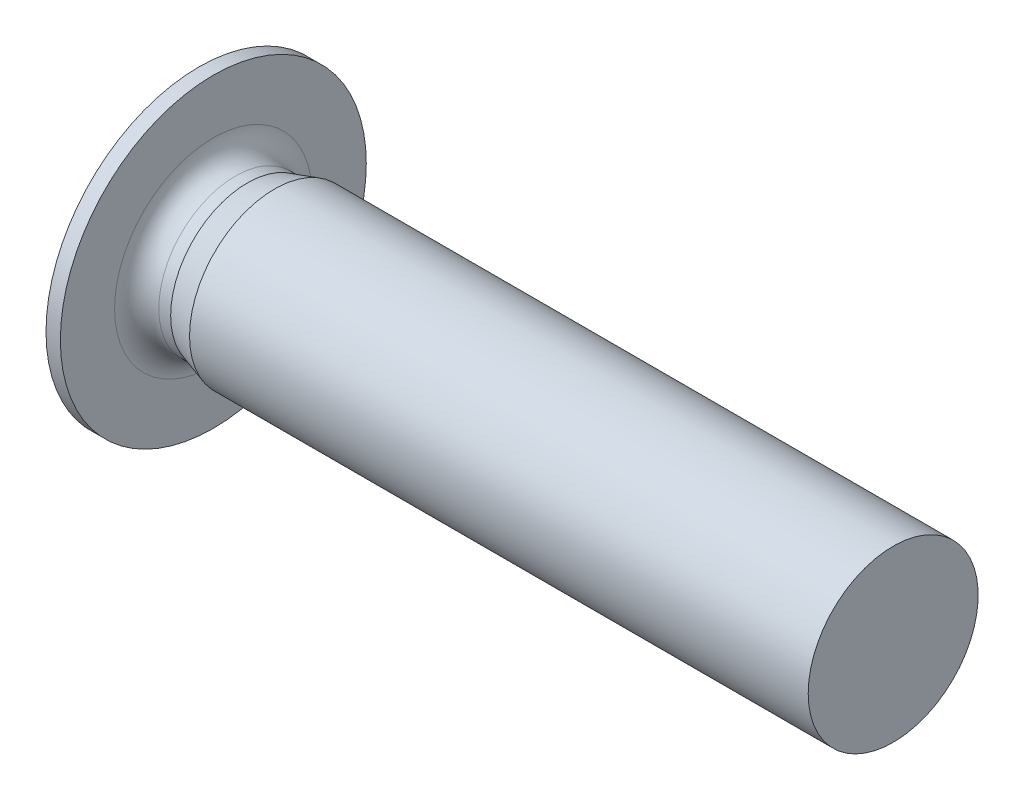
ISO-10303-21;
HEADER;
FILE_DESCRIPTION(('STEP AP214'),'2;1');
FILE_NAME('part.step','',(''),(''),'','','');
FILE_SCHEMA(('AUTOMOTIVE_DESIGN { 1 0 10303 214 1 1 1 1 }'));
ENDSEC;
DATA;
#1=APPLICATION_CONTEXT('core data for automotive mechanical design processes');
#2=APPLICATION_PROTOCOL_DEFINITION('international standard','automotive_design',2000,#1);
#3=PRODUCT_CONTEXT('',#1,'mechanical');
#4=PRODUCT('Part','Part','',(#3));
#5=PRODUCT_RELATED_PRODUCT_CATEGORY('part','',(#4));
#6=PRODUCT_DEFINITION_FORMATION('','',#4);
#7=PRODUCT_DEFINITION_CONTEXT('part definition',#1,'design');
#8=PRODUCT_DEFINITION('design','',#6,#7);
#9=PRODUCT_DEFINITION_SHAPE('','',#8);
#10=(LENGTH_UNIT() NAMED_UNIT(*) SI_UNIT(.MILLI.,.METRE.));
#11=(NAMED_UNIT(*) PLANE_ANGLE_UNIT() SI_UNIT($,.RADIAN.));
#12=(NAMED_UNIT(*) SI_UNIT($,.STERADIAN.) SOLID_ANGLE_UNIT());
#13=UNCERTAINTY_MEASURE_WITH_UNIT(LENGTH_MEASURE(1.E-05),#10,'distance_accuracy_value','');
#14=(GEOMETRIC_REPRESENTATION_CONTEXT(3) GLOBAL_UNCERTAINTY_ASSIGNED_CONTEXT((#13)) GLOBAL_UNIT_ASSIGNED_CONTEXT((#10,
#11,#12)) REPRESENTATION_CONTEXT('',''));
#15=CARTESIAN_POINT('',(0.,0.,0.));
#16=DIRECTION('',(0.,0.,1.));
#17=DIRECTION('',(1.,0.,0.));
#18=AXIS2_PLACEMENT_3D('',#15,#16,#17);
#19=CARTESIAN_POINT('',(0.6,0.,0.));
#20=DIRECTION('',(-1.,0.,0.));
#21=DIRECTION('',(0.,0.,1.));
#22=AXIS2_PLACEMENT_3D('',#19,#20,#21);
#23=PLANE('',#22);
#24=DIRECTION('',(0.,0.866025403784439,0.5));
#25=VECTOR('',#24,1.);
#26=CARTESIAN_POINT('',(0.6,-1.25,0.721687836487032));
#27=LINE('',#26,#25);
#28=CARTESIAN_POINT('',(0.6,-1.25,0.721687836487032));
#29=VERTEX_POINT('',#28);
#30=CARTESIAN_POINT('',(0.6,-0.625,1.08253175473055));
#31=VERTEX_POINT('',#30);
#32=EDGE_CURVE('E223',#29,#31,#27,.T.);
#33=ORIENTED_EDGE('',*,*,#32,.T.);
#34=CARTESIAN_POINT('',(0.6,0.,0.));
#35=DIRECTION('',(-1.,0.,0.));
#36=DIRECTION('',(0.,0.,1.));
#37=AXIS2_PLACEMENT_3D('',#34,#35,#36);
#38=CIRCLE('',#37,1.25);
#39=CARTESIAN_POINT('',(0.6,-1.25,0.));
#40=VERTEX_POINT('',#39);
#41=EDGE_CURVE('E58',#31,#40,#38,.F.);
#42=ORIENTED_EDGE('',*,*,#41,.T.);
#43=DIRECTION('',(0.,0.,1.));
#44=VECTOR('',#43,1.);
#45=CARTESIAN_POINT('',(0.6,-1.25,-0.721687836487033));
#46=LINE('',#45,#44);
#47=EDGE_CURVE('E220',#40,#29,#46,.T.);
#48=ORIENTED_EDGE('',*,*,#47,.T.);
#49=EDGE_LOOP('',(#33,#42,#48));
#50=FACE_BOUND('',#49,.T.);
#51=ADVANCED_FACE('F43',(#50),#23,.T.);
#52=CARTESIAN_POINT('',(0.6,-1.25,-0.721687836487033));
#53=VERTEX_POINT('',#52);
#54=EDGE_CURVE('E221',#53,#40,#46,.T.);
#55=ORIENTED_EDGE('',*,*,#54,.T.);
#56=CARTESIAN_POINT('',(0.6,-0.625,-1.08253175473055));
#57=VERTEX_POINT('',#56);
#58=EDGE_CURVE('E201',#40,#57,#38,.F.);
#59=ORIENTED_EDGE('',*,*,#58,.T.);
#60=DIRECTION('',(0.,-0.866025403784439,0.5));
#61=VECTOR('',#60,1.);
#62=CARTESIAN_POINT('',(0.6,0.,-1.44337567297406));
#63=LINE('',#62,#61);
#64=EDGE_CURVE('E217',#57,#53,#63,.T.);
#65=ORIENTED_EDGE('',*,*,#64,.T.);
#66=EDGE_LOOP('',(#55,#59,#65));
#67=FACE_BOUND('',#66,.T.);
#68=ADVANCED_FACE('F246',(#67),#23,.T.);
#69=CARTESIAN_POINT('',(0.6,0.,-1.44337567297406));
#70=VERTEX_POINT('',#69);
#71=EDGE_CURVE('E214',#70,#57,#63,.T.);
#72=ORIENTED_EDGE('',*,*,#71,.T.);
#73=CARTESIAN_POINT('',(0.6,0.625,-1.08253175473055));
#74=VERTEX_POINT('',#73);
#75=EDGE_CURVE('E138',#57,#74,#38,.F.);
#76=ORIENTED_EDGE('',*,*,#75,.T.);
#77=DIRECTION('',(0.,-0.866025403784439,-0.5));
#78=VECTOR('',#77,1.);
#79=CARTESIAN_POINT('',(0.6,1.25,-0.721687836487032));
#80=LINE('',#79,#78);
#81=EDGE_CURVE('E172',#74,#70,#80,.T.);
#82=ORIENTED_EDGE('',*,*,#81,.T.);
#83=EDGE_LOOP('',(#72,#76,#82));
#84=FACE_BOUND('',#83,.T.);
#85=ADVANCED_FACE('F212',(#84),#23,.T.);
#86=CARTESIAN_POINT('',(0.6,1.25,-0.721687836487032));
#87=VERTEX_POINT('',#86);
#88=EDGE_CURVE('E137',#87,#74,#80,.T.);
#89=ORIENTED_EDGE('',*,*,#88,.T.);
#90=CARTESIAN_POINT('',(0.6,1.25,0.));
#91=VERTEX_POINT('',#90);
#92=EDGE_CURVE('E123',#74,#91,#38,.F.);
#93=ORIENTED_EDGE('',*,*,#92,.T.);
#94=DIRECTION('',(0.,0.,-1.));
#95=VECTOR('',#94,1.);
#96=CARTESIAN_POINT('',(0.6,1.25,0.721687836487033));
#97=LINE('',#96,#95);
#98=EDGE_CURVE('E134',#91,#87,#97,.T.);
#99=ORIENTED_EDGE('',*,*,#98,.T.);
#100=EDGE_LOOP('',(#89,#93,#99));
#101=FACE_BOUND('',#100,.T.);
#102=ADVANCED_FACE('F133',(#101),#23,.T.);
#103=CARTESIAN_POINT('',(0.6,1.25,0.721687836487033));
#104=VERTEX_POINT('',#103);
#105=EDGE_CURVE('E144',#104,#91,#97,.T.);
#106=ORIENTED_EDGE('',*,*,#105,.T.);
#107=CARTESIAN_POINT('',(0.6,0.,0.));
#108=DIRECTION('',(1.,0.,0.));
#109=DIRECTION('',(0.,1.,0.));
#110=AXIS2_PLACEMENT_3D('',#107,#108,#109);
#111=CIRCLE('',#110,1.25);
#112=CARTESIAN_POINT('',(0.6,0.625,1.08253175473055));
#113=VERTEX_POINT('',#112);
#114=EDGE_CURVE('E121',#91,#113,#111,.T.);
#115=ORIENTED_EDGE('',*,*,#114,.T.);
#116=DIRECTION('',(0.,0.866025403784439,-0.5));
#117=VECTOR('',#116,1.);
#118=CARTESIAN_POINT('',(0.6,0.,1.44337567297406));
#119=LINE('',#118,#117);
#120=EDGE_CURVE('E149',#113,#104,#119,.T.);
#121=ORIENTED_EDGE('',*,*,#120,.T.);
#122=EDGE_LOOP('',(#106,#115,#121));
#123=FACE_BOUND('',#122,.T.);
#124=ADVANCED_FACE('F148',(#123),#23,.T.);
#125=CARTESIAN_POINT('',(-1.,3.5,0.));
#126=DIRECTION('',(1.,0.,0.));
#127=DIRECTION('',(0.,0.,-1.));
#128=AXIS2_PLACEMENT_3D('',#125,#126,#127);
#129=PLANE('',#128);
#130=DIRECTION('',(0.,-0.866025403784439,0.5));
#131=VECTOR('',#130,1.);
#132=CARTESIAN_POINT('',(-1.,0.,-1.44337567297406));
#133=LINE('',#132,#131);
#134=CARTESIAN_POINT('',(-1.,0.,-1.44337567297407));
#135=VERTEX_POINT('',#134);
#136=CARTESIAN_POINT('',(-1.,-1.25,-0.721687836487033));
#137=VERTEX_POINT('',#136);
#138=EDGE_CURVE('E158',#135,#137,#133,.T.);
#139=ORIENTED_EDGE('',*,*,#138,.F.);
#140=DIRECTION('',(0.,-0.866025403784439,-0.5));
#141=VECTOR('',#140,1.);
#142=CARTESIAN_POINT('',(-1.,1.25,-0.721687836487032));
#143=LINE('',#142,#141);
#144=CARTESIAN_POINT('',(-1.,1.25,-0.721687836487032));
#145=VERTEX_POINT('',#144);
#146=EDGE_CURVE('E66',#145,#135,#143,.T.);
#147=ORIENTED_EDGE('',*,*,#146,.F.);
#148=DIRECTION('',(0.,0.,-1.));
#149=VECTOR('',#148,1.);
#150=CARTESIAN_POINT('',(-1.,1.25,0.721687836487033));
#151=LINE('',#150,#149);
#152=CARTESIAN_POINT('',(-1.,1.25,0.721687836487033));
#153=VERTEX_POINT('',#152);
#154=EDGE_CURVE('E170',#153,#145,#151,.T.);
#155=ORIENTED_EDGE('',*,*,#154,.F.);
#156=DIRECTION('',(0.,0.866025403784439,-0.5));
#157=VECTOR('',#156,1.);
#158=CARTESIAN_POINT('',(-1.,0.,1.44337567297406));
#159=LINE('',#158,#157);
#160=CARTESIAN_POINT('',(-1.,0.,1.44337567297406));
#161=VERTEX_POINT('',#160);
#162=EDGE_CURVE('E167',#161,#153,#159,.T.);
#163=ORIENTED_EDGE('',*,*,#162,.F.);
#164=DIRECTION('',(0.,0.866025403784439,0.5));
#165=VECTOR('',#164,1.);
#166=CARTESIAN_POINT('',(-1.,-1.25,0.721687836487032));
#167=LINE('',#166,#165);
#168=CARTESIAN_POINT('',(-1.,-1.25,0.721687836487032));
#169=VERTEX_POINT('',#168);
#170=EDGE_CURVE('E164',#169,#161,#167,.T.);
#171=ORIENTED_EDGE('',*,*,#170,.F.);
#172=DIRECTION('',(0.,0.,1.));
#173=VECTOR('',#172,1.);
#174=CARTESIAN_POINT('',(-1.,-1.25,-0.721687836487033));
#175=LINE('',#174,#173);
#176=EDGE_CURVE('E161',#137,#169,#175,.T.);
#177=ORIENTED_EDGE('',*,*,#176,.F.);
#178=EDGE_LOOP('',(#139,#147,#155,#163,#171,#177));
#179=FACE_BOUND('',#178,.T.);
#180=CARTESIAN_POINT('',(-1.,0.,0.));
#181=DIRECTION('',(-1.,0.,0.));
#182=DIRECTION('',(0.,0.,1.));
#183=AXIS2_PLACEMENT_3D('',#180,#181,#182);
#184=CIRCLE('',#183,3.5);
#185=CARTESIAN_POINT('',(-1.,0.,3.5));
#186=VERTEX_POINT('',#185);
#187=EDGE_CURVE('E174',#186,#186,#184,.T.);
#188=ORIENTED_EDGE('',*,*,#187,.T.);
#189=EDGE_LOOP('',(#188));
#190=FACE_BOUND('',#189,.T.);
#191=ADVANCED_FACE('F239',(#179,#190),#129,.F.);
#192=CARTESIAN_POINT('',(20.,0.,0.));
#193=DIRECTION('',(-1.,0.,0.));
#194=DIRECTION('',(0.,0.,1.));
#195=AXIS2_PLACEMENT_3D('',#192,#193,#194);
#196=PLANE('',#195);
#197=CARTESIAN_POINT('',(20.,0.,0.));
#198=DIRECTION('',(-1.,0.,0.));
#199=DIRECTION('',(0.,0.,1.));
#200=AXIS2_PLACEMENT_3D('',#197,#198,#199);
#201=CIRCLE('',#200,2.5);
#202=CARTESIAN_POINT('',(20.,0.,2.5));
#203=VERTEX_POINT('',#202);
#204=EDGE_CURVE('E196',#203,#203,#201,.T.);
#205=ORIENTED_EDGE('',*,*,#204,.F.);
#206=EDGE_LOOP('',(#205));
#207=FACE_BOUND('',#206,.T.);
#208=ADVANCED_FACE('F266',(#207),#196,.F.);
#209=CARTESIAN_POINT('',(-1.,0.,0.));
#210=DIRECTION('',(-1.,0.,0.));
#211=DIRECTION('',(0.,0.,1.));
#212=AXIS2_PLACEMENT_3D('',#209,#210,#211);
#213=CYLINDRICAL_SURFACE('',#212,2.5);
#214=CARTESIAN_POINT('',(1.8,0.,0.));
#215=DIRECTION('',(-1.,0.,0.));
#216=DIRECTION('',(0.,0.,1.));
#217=AXIS2_PLACEMENT_3D('',#214,#215,#216);
#218=CIRCLE('',#217,2.5);
#219=CARTESIAN_POINT('',(1.8,0.,2.5));
#220=VERTEX_POINT('',#219);
#221=EDGE_CURVE('E193',#220,#220,#218,.T.);
#222=ORIENTED_EDGE('',*,*,#221,.F.);
#223=EDGE_LOOP('',(#222));
#224=FACE_BOUND('',#223,.T.);
#225=ORIENTED_EDGE('',*,*,#204,.T.);
#226=EDGE_LOOP('',(#225));
#227=FACE_BOUND('',#226,.T.);
#228=ADVANCED_FACE('F330',(#224,#227),#213,.T.);
#229=CARTESIAN_POINT('',(1.8,0.,0.));
#230=DIRECTION('',(1.,0.,0.));
#231=DIRECTION('',(0.,0.,-1.));
#232=AXIS2_PLACEMENT_3D('',#229,#230,#231);
#233=CONICAL_SURFACE('',#232,2.5,0.297180830416315);
#234=CARTESIAN_POINT('',(1.,0.,0.));
#235=DIRECTION('',(-1.,0.,0.));
#236=DIRECTION('',(0.,0.,1.));
#237=AXIS2_PLACEMENT_3D('',#234,#235,#236);
#238=CIRCLE('',#237,2.255);
#239=CARTESIAN_POINT('',(1.,0.,2.255));
#240=VERTEX_POINT('',#239);
#241=EDGE_CURVE('E190',#240,#240,#238,.T.);
#242=ORIENTED_EDGE('',*,*,#241,.F.);
#243=EDGE_LOOP('',(#242));
#244=FACE_BOUND('',#243,.T.);
#245=ORIENTED_EDGE('',*,*,#221,.T.);
#246=EDGE_LOOP('',(#245));
#247=FACE_BOUND('',#246,.T.);
#248=ADVANCED_FACE('F324',(#244,#247),#233,.T.);
#249=CARTESIAN_POINT('',(-1.,0.,0.));
#250=DIRECTION('',(-1.,0.,0.));
#251=DIRECTION('',(0.,0.,1.));
#252=AXIS2_PLACEMENT_3D('',#249,#250,#251);
#253=CYLINDRICAL_SURFACE('',#252,2.255);
#254=CARTESIAN_POINT('',(0.65,0.,0.));
#255=DIRECTION('',(-1.,0.,0.));
#256=DIRECTION('',(0.,0.,1.));
#257=AXIS2_PLACEMENT_3D('',#254,#255,#256);
#258=CIRCLE('',#257,2.255);
#259=CARTESIAN_POINT('',(0.65,0.,2.255));
#260=VERTEX_POINT('',#259);
#261=EDGE_CURVE('E11',#260,#260,#258,.F.);
#262=ORIENTED_EDGE('',*,*,#261,.T.);
#263=EDGE_LOOP('',(#262));
#264=FACE_BOUND('',#263,.T.);
#265=ORIENTED_EDGE('',*,*,#241,.T.);
#266=EDGE_LOOP('',(#265));
#267=FACE_BOUND('',#266,.T.);
#268=ADVANCED_FACE('F329',(#264,#267),#253,.T.);
#269=CARTESIAN_POINT('',(0.,2.255,0.));
#270=DIRECTION('',(-1.,0.,0.));
#271=DIRECTION('',(0.,0.,1.));
#272=AXIS2_PLACEMENT_3D('',#269,#270,#271);
#273=PLANE('',#272);
#274=CARTESIAN_POINT('',(0.,0.,0.));
#275=DIRECTION('',(-1.,0.,0.));
#276=DIRECTION('',(0.,0.,1.));
#277=AXIS2_PLACEMENT_3D('',#274,#275,#276);
#278=CIRCLE('',#277,2.905);
#279=CARTESIAN_POINT('',(0.,0.,2.905));
#280=VERTEX_POINT('',#279);
#281=EDGE_CURVE('E51',#280,#280,#278,.T.);
#282=ORIENTED_EDGE('',*,*,#281,.T.);
#283=EDGE_LOOP('',(#282));
#284=FACE_BOUND('',#283,.T.);
#285=CARTESIAN_POINT('',(0.,0.,0.));
#286=DIRECTION('',(-1.,0.,0.));
#287=DIRECTION('',(0.,0.,1.));
#288=AXIS2_PLACEMENT_3D('',#285,#286,#287);
#289=CIRCLE('',#288,4.5);
#290=CARTESIAN_POINT('',(0.,0.,4.5));
#291=VERTEX_POINT('',#290);
#292=EDGE_CURVE('E187',#291,#291,#289,.T.);
#293=ORIENTED_EDGE('',*,*,#292,.F.);
#294=EDGE_LOOP('',(#293));
#295=FACE_BOUND('',#294,.T.);
#296=ADVANCED_FACE('F315',(#284,#295),#273,.F.);
#297=CARTESIAN_POINT('',(-1.,0.,0.));
#298=DIRECTION('',(-1.,0.,0.));
#299=DIRECTION('',(0.,0.,1.));
#300=AXIS2_PLACEMENT_3D('',#297,#298,#299);
#301=CYLINDRICAL_SURFACE('',#300,4.5);
#302=CARTESIAN_POINT('',(-0.422649730810373,0.,0.));
#303=DIRECTION('',(-1.,0.,0.));
#304=DIRECTION('',(0.,0.,1.));
#305=AXIS2_PLACEMENT_3D('',#302,#303,#304);
#306=CIRCLE('',#305,4.5);
#307=CARTESIAN_POINT('',(-0.422649730810373,0.,4.5));
#308=VERTEX_POINT('',#307);
#309=EDGE_CURVE('E184',#308,#308,#306,.T.);
#310=ORIENTED_EDGE('',*,*,#309,.F.);
#311=EDGE_LOOP('',(#310));
#312=FACE_BOUND('',#311,.T.);
#313=ORIENTED_EDGE('',*,*,#292,.T.);
#314=EDGE_LOOP('',(#313));
#315=FACE_BOUND('',#314,.T.);
#316=ADVANCED_FACE('F302',(#312,#315),#301,.T.);
#317=CARTESIAN_POINT('',(-0.422649730810373,0.,0.));
#318=DIRECTION('',(1.,0.,0.));
#319=DIRECTION('',(0.,0.,-1.));
#320=AXIS2_PLACEMENT_3D('',#317,#318,#319);
#321=CONICAL_SURFACE('',#320,4.5,1.0471975511966);
#322=ORIENTED_EDGE('',*,*,#187,.F.);
#323=EDGE_LOOP('',(#322));
#324=FACE_BOUND('',#323,.T.);
#325=ORIENTED_EDGE('',*,*,#309,.T.);
#326=EDGE_LOOP('',(#325));
#327=FACE_BOUND('',#326,.T.);
#328=ADVANCED_FACE('F297',(#324,#327),#321,.T.);
#329=CARTESIAN_POINT('',(0.6,1.25,-0.721687836487032));
#330=DIRECTION('',(0.,0.5,-0.866025403784439));
#331=DIRECTION('',(0.,0.866025403784439,0.5));
#332=AXIS2_PLACEMENT_3D('',#329,#330,#331);
#333=PLANE('',#332);
#334=ORIENTED_EDGE('',*,*,#146,.T.);
#335=DIRECTION('',(-1.,0.,0.));
#336=VECTOR('',#335,1.);
#337=CARTESIAN_POINT('',(0.6,0.,-1.44337567297406));
#338=LINE('',#337,#336);
#339=EDGE_CURVE('E151',#70,#135,#338,.T.);
#340=ORIENTED_EDGE('',*,*,#339,.F.);
#341=ORIENTED_EDGE('',*,*,#81,.F.);
#342=ORIENTED_EDGE('',*,*,#88,.F.);
#343=DIRECTION('',(-1.,0.,0.));
#344=VECTOR('',#343,1.);
#345=CARTESIAN_POINT('',(0.6,1.25,-0.721687836487032));
#346=LINE('',#345,#344);
#347=EDGE_CURVE('E145',#87,#145,#346,.T.);
#348=ORIENTED_EDGE('',*,*,#347,.T.);
#349=EDGE_LOOP('',(#334,#340,#341,#342,#348));
#350=FACE_BOUND('',#349,.T.);
#351=ADVANCED_FACE('F215',(#350),#333,.F.);
#352=CARTESIAN_POINT('',(0.6,1.25,0.721687836487033));
#353=DIRECTION('',(0.,1.,0.));
#354=DIRECTION('',(0.,0.,1.));
#355=AXIS2_PLACEMENT_3D('',#352,#353,#354);
#356=PLANE('',#355);
#357=ORIENTED_EDGE('',*,*,#154,.T.);
#358=ORIENTED_EDGE('',*,*,#347,.F.);
#359=ORIENTED_EDGE('',*,*,#98,.F.);
#360=ORIENTED_EDGE('',*,*,#105,.F.);
#361=DIRECTION('',(-1.,0.,0.));
#362=VECTOR('',#361,1.);
#363=CARTESIAN_POINT('',(0.6,1.25,0.721687836487033));
#364=LINE('',#363,#362);
#365=EDGE_CURVE('E175',#104,#153,#364,.T.);
#366=ORIENTED_EDGE('',*,*,#365,.T.);
#367=EDGE_LOOP('',(#357,#358,#359,#360,#366));
#368=FACE_BOUND('',#367,.T.);
#369=ADVANCED_FACE('F143',(#368),#356,.F.);
#370=CARTESIAN_POINT('',(0.6,0.,1.44337567297406));
#371=DIRECTION('',(0.,0.5,0.866025403784439));
#372=DIRECTION('',(0.,-0.866025403784439,0.5));
#373=AXIS2_PLACEMENT_3D('',#370,#371,#372);
#374=PLANE('',#373);
#375=ORIENTED_EDGE('',*,*,#162,.T.);
#376=ORIENTED_EDGE('',*,*,#365,.F.);
#377=ORIENTED_EDGE('',*,*,#120,.F.);
#378=CARTESIAN_POINT('',(0.6,0.,1.44337567297406));
#379=VERTEX_POINT('',#378);
#380=EDGE_CURVE('E146',#379,#113,#119,.T.);
#381=ORIENTED_EDGE('',*,*,#380,.F.);
#382=DIRECTION('',(-1.,0.,0.));
#383=VECTOR('',#382,1.);
#384=CARTESIAN_POINT('',(0.6,0.,1.44337567297406));
#385=LINE('',#384,#383);
#386=EDGE_CURVE('E177',#379,#161,#385,.T.);
#387=ORIENTED_EDGE('',*,*,#386,.T.);
#388=EDGE_LOOP('',(#375,#376,#377,#381,#387));
#389=FACE_BOUND('',#388,.T.);
#390=ADVANCED_FACE('F235',(#389),#374,.F.);
#391=CARTESIAN_POINT('',(0.6,-1.25,0.721687836487032));
#392=DIRECTION('',(0.,-0.5,0.866025403784439));
#393=DIRECTION('',(0.,-0.866025403784439,-0.5));
#394=AXIS2_PLACEMENT_3D('',#391,#392,#393);
#395=PLANE('',#394);
#396=ORIENTED_EDGE('',*,*,#170,.T.);
#397=ORIENTED_EDGE('',*,*,#386,.F.);
#398=EDGE_CURVE('E222',#31,#379,#27,.T.);
#399=ORIENTED_EDGE('',*,*,#398,.F.);
#400=ORIENTED_EDGE('',*,*,#32,.F.);
#401=DIRECTION('',(-1.,0.,0.));
#402=VECTOR('',#401,1.);
#403=CARTESIAN_POINT('',(0.6,-1.25,0.721687836487032));
#404=LINE('',#403,#402);
#405=EDGE_CURVE('E179',#29,#169,#404,.T.);
#406=ORIENTED_EDGE('',*,*,#405,.T.);
#407=EDGE_LOOP('',(#396,#397,#399,#400,#406));
#408=FACE_BOUND('',#407,.T.);
#409=ADVANCED_FACE('F231',(#408),#395,.F.);
#410=CARTESIAN_POINT('',(0.6,-1.25,-0.721687836487033));
#411=DIRECTION('',(0.,-1.,0.));
#412=DIRECTION('',(0.,0.,-1.));
#413=AXIS2_PLACEMENT_3D('',#410,#411,#412);
#414=PLANE('',#413);
#415=ORIENTED_EDGE('',*,*,#176,.T.);
#416=ORIENTED_EDGE('',*,*,#405,.F.);
#417=ORIENTED_EDGE('',*,*,#47,.F.);
#418=ORIENTED_EDGE('',*,*,#54,.F.);
#419=DIRECTION('',(-1.,0.,0.));
#420=VECTOR('',#419,1.);
#421=CARTESIAN_POINT('',(0.6,-1.25,-0.721687836487033));
#422=LINE('',#421,#420);
#423=EDGE_CURVE('E152',#53,#137,#422,.T.);
#424=ORIENTED_EDGE('',*,*,#423,.T.);
#425=EDGE_LOOP('',(#415,#416,#417,#418,#424));
#426=FACE_BOUND('',#425,.T.);
#427=ADVANCED_FACE('F248',(#426),#414,.F.);
#428=CARTESIAN_POINT('',(0.6,0.,-1.44337567297406));
#429=DIRECTION('',(0.,-0.5,-0.866025403784439));
#430=DIRECTION('',(0.,0.866025403784439,-0.5));
#431=AXIS2_PLACEMENT_3D('',#428,#429,#430);
#432=PLANE('',#431);
#433=ORIENTED_EDGE('',*,*,#138,.T.);
#434=ORIENTED_EDGE('',*,*,#423,.F.);
#435=ORIENTED_EDGE('',*,*,#64,.F.);
#436=ORIENTED_EDGE('',*,*,#71,.F.);
#437=ORIENTED_EDGE('',*,*,#339,.T.);
#438=EDGE_LOOP('',(#433,#434,#435,#436,#437));
#439=FACE_BOUND('',#438,.T.);
#440=ADVANCED_FACE('F244',(#439),#432,.F.);
#441=ORIENTED_EDGE('',*,*,#380,.T.);
#442=EDGE_CURVE('E125',#113,#31,#38,.F.);
#443=ORIENTED_EDGE('',*,*,#442,.T.);
#444=ORIENTED_EDGE('',*,*,#398,.T.);
#445=EDGE_LOOP('',(#441,#443,#444));
#446=FACE_BOUND('',#445,.T.);
#447=ADVANCED_FACE('F118',(#446),#23,.T.);
#448=CARTESIAN_POINT('',(0.6,0.,0.));
#449=DIRECTION('',(-1.,0.,0.));
#450=DIRECTION('',(0.,-1.,0.));
#451=AXIS2_PLACEMENT_3D('',#448,#449,#450);
#452=CONICAL_SURFACE('',#451,1.25,1.02974425867665);
#453=CARTESIAN_POINT('',(1.35107577378446,0.,0.));
#454=VERTEX_POINT('',#453);
#455=VERTEX_LOOP('',#454);
#456=FACE_BOUND('',#455,.T.);
#457=ORIENTED_EDGE('',*,*,#114,.F.);
#458=ORIENTED_EDGE('',*,*,#92,.F.);
#459=ORIENTED_EDGE('',*,*,#75,.F.);
#460=ORIENTED_EDGE('',*,*,#58,.F.);
#461=ORIENTED_EDGE('',*,*,#41,.F.);
#462=ORIENTED_EDGE('',*,*,#442,.F.);
#463=EDGE_LOOP('',(#457,#458,#459,#460,#461,#462));
#464=FACE_BOUND('',#463,.T.);
#465=ADVANCED_FACE('F116',(#456,#464),#452,.F.);
#466=CARTESIAN_POINT('',(0.65,0.,0.));
#467=DIRECTION('',(-1.,0.,0.));
#468=DIRECTION('',(0.,0.,1.));
#469=AXIS2_PLACEMENT_3D('',#466,#467,#468);
#470=TOROIDAL_SURFACE('',#469,2.905,0.65);
#471=ORIENTED_EDGE('',*,*,#261,.F.);
#472=EDGE_LOOP('',(#471));
#473=FACE_BOUND('',#472,.T.);
#474=ORIENTED_EDGE('',*,*,#281,.F.);
#475=EDGE_LOOP('',(#474));
#476=FACE_BOUND('',#475,.T.);
#477=ADVANCED_FACE('F45',(#473,#476),#470,.F.);
#478=CLOSED_SHELL('',(#51,#68,#85,#102,#124,#191,#208,#228,#248,#268,#296,#316,#328,#351,#369,
#390,#409,#427,#440,#447,#465,#477));
#479=MANIFOLD_SOLID_BREP('B2',#478);
#480=ADVANCED_BREP_SHAPE_REPRESENTATION('',(#18,#479),#14);
#481=SHAPE_DEFINITION_REPRESENTATION(#9,#480);
ENDSEC;
END-ISO-10303-21;
